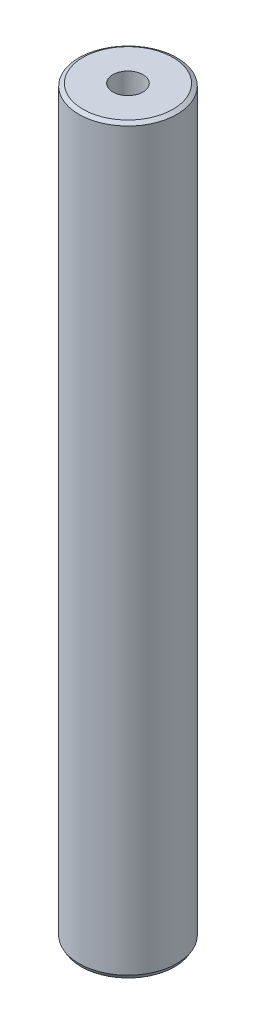
ISO-10303-21;
HEADER;
FILE_DESCRIPTION(('STEP AP214'),'2;1');
FILE_NAME('part.step','',(''),(''),'','','');
FILE_SCHEMA(('AUTOMOTIVE_DESIGN { 1 0 10303 214 1 1 1 1 }'));
ENDSEC;
DATA;
#1=APPLICATION_CONTEXT('core data for automotive mechanical design processes');
#2=APPLICATION_PROTOCOL_DEFINITION('international standard','automotive_design',2000,#1);
#3=PRODUCT_CONTEXT('',#1,'mechanical');
#4=PRODUCT('Part','Part','',(#3));
#5=PRODUCT_RELATED_PRODUCT_CATEGORY('part','',(#4));
#6=PRODUCT_DEFINITION_FORMATION('','',#4);
#7=PRODUCT_DEFINITION_CONTEXT('part definition',#1,'design');
#8=PRODUCT_DEFINITION('design','',#6,#7);
#9=PRODUCT_DEFINITION_SHAPE('','',#8);
#10=(LENGTH_UNIT() NAMED_UNIT(*) SI_UNIT(.MILLI.,.METRE.));
#11=(NAMED_UNIT(*) PLANE_ANGLE_UNIT() SI_UNIT($,.RADIAN.));
#12=(NAMED_UNIT(*) SI_UNIT($,.STERADIAN.) SOLID_ANGLE_UNIT());
#13=UNCERTAINTY_MEASURE_WITH_UNIT(LENGTH_MEASURE(1.E-05),#10,'distance_accuracy_value','');
#14=(GEOMETRIC_REPRESENTATION_CONTEXT(3) GLOBAL_UNCERTAINTY_ASSIGNED_CONTEXT((#13)) GLOBAL_UNIT_ASSIGNED_CONTEXT((#10,
#11,#12)) REPRESENTATION_CONTEXT('',''));
#15=CARTESIAN_POINT('',(0.,0.,0.));
#16=DIRECTION('',(0.,0.,1.));
#17=DIRECTION('',(1.,0.,0.));
#18=AXIS2_PLACEMENT_3D('',#15,#16,#17);
#19=CARTESIAN_POINT('',(0.,529.479482132108,0.));
#20=DIRECTION('',(0.,-1.,0.));
#21=DIRECTION('',(0.,0.,-1.));
#22=AXIS2_PLACEMENT_3D('',#19,#20,#21);
#23=CYLINDRICAL_SURFACE('',#22,35.);
#24=CARTESIAN_POINT('',(0.,527.811861999317,0.));
#25=DIRECTION('',(0.,1.,0.));
#26=DIRECTION('',(0.,0.,1.));
#27=AXIS2_PLACEMENT_3D('',#24,#25,#26);
#28=CIRCLE('',#27,35.);
#29=CARTESIAN_POINT('',(0.,527.811861999317,35.));
#30=VERTEX_POINT('',#29);
#31=EDGE_CURVE('E50',#30,#30,#28,.F.);
#32=ORIENTED_EDGE('',*,*,#31,.T.);
#33=EDGE_LOOP('',(#32));
#34=FACE_BOUND('',#33,.T.);
#35=CARTESIAN_POINT('',(0.,2.88840279771785,0.));
#36=DIRECTION('',(0.,1.,0.));
#37=DIRECTION('',(0.,0.,1.));
#38=AXIS2_PLACEMENT_3D('',#35,#36,#37);
#39=CIRCLE('',#38,35.);
#40=CARTESIAN_POINT('',(0.,2.88840279771785,35.));
#41=VERTEX_POINT('',#40);
#42=EDGE_CURVE('E51',#41,#41,#39,.T.);
#43=ORIENTED_EDGE('',*,*,#42,.T.);
#44=EDGE_LOOP('',(#43));
#45=FACE_BOUND('',#44,.T.);
#46=ADVANCED_FACE('F39',(#34,#45),#23,.T.);
#47=CARTESIAN_POINT('',(0.,529.479482132108,0.));
#48=DIRECTION('',(0.,1.,0.));
#49=DIRECTION('',(0.,0.,1.));
#50=AXIS2_PLACEMENT_3D('',#47,#48,#49);
#51=PLANE('',#50);
#52=CARTESIAN_POINT('',(0.,529.479482132108,0.));
#53=DIRECTION('',(0.,1.,0.));
#54=DIRECTION('',(0.,0.,1.));
#55=AXIS2_PLACEMENT_3D('',#52,#53,#54);
#56=CIRCLE('',#55,32.1115972022821);
#57=CARTESIAN_POINT('',(0.,529.479482132108,32.1115972022821));
#58=VERTEX_POINT('',#57);
#59=EDGE_CURVE('E54',#58,#58,#56,.T.);
#60=ORIENTED_EDGE('',*,*,#59,.T.);
#61=EDGE_LOOP('',(#60));
#62=FACE_BOUND('',#61,.T.);
#63=CARTESIAN_POINT('',(0.,529.479482132108,0.));
#64=DIRECTION('',(0.,1.,0.));
#65=DIRECTION('',(0.,0.,1.));
#66=AXIS2_PLACEMENT_3D('',#63,#64,#65);
#67=CIRCLE('',#66,10.7695642763049);
#68=CARTESIAN_POINT('',(0.,529.479482132108,10.7695642763049));
#69=VERTEX_POINT('',#68);
#70=EDGE_CURVE('E58',#69,#69,#67,.T.);
#71=ORIENTED_EDGE('',*,*,#70,.F.);
#72=EDGE_LOOP('',(#71));
#73=FACE_BOUND('',#72,.T.);
#74=ADVANCED_FACE('F69',(#62,#73),#51,.T.);
#75=CARTESIAN_POINT('',(0.,0.,0.));
#76=DIRECTION('',(0.,1.,0.));
#77=DIRECTION('',(0.,0.,1.));
#78=AXIS2_PLACEMENT_3D('',#75,#76,#77);
#79=PLANE('',#78);
#80=CARTESIAN_POINT('',(0.,0.,0.));
#81=DIRECTION('',(0.,1.,0.));
#82=DIRECTION('',(0.,0.,1.));
#83=AXIS2_PLACEMENT_3D('',#80,#81,#82);
#84=CIRCLE('',#83,33.3323798672095);
#85=CARTESIAN_POINT('',(0.,0.,33.3323798672095));
#86=VERTEX_POINT('',#85);
#87=EDGE_CURVE('E10',#86,#86,#84,.F.);
#88=ORIENTED_EDGE('',*,*,#87,.T.);
#89=EDGE_LOOP('',(#88));
#90=FACE_BOUND('',#89,.T.);
#91=CARTESIAN_POINT('',(0.,0.,0.));
#92=DIRECTION('',(0.,1.,0.));
#93=DIRECTION('',(0.,0.,1.));
#94=AXIS2_PLACEMENT_3D('',#91,#92,#93);
#95=CIRCLE('',#94,10.7695642763049);
#96=CARTESIAN_POINT('',(0.,0.,10.7695642763049));
#97=VERTEX_POINT('',#96);
#98=EDGE_CURVE('E63',#97,#97,#95,.T.);
#99=ORIENTED_EDGE('',*,*,#98,.T.);
#100=EDGE_LOOP('',(#99));
#101=FACE_BOUND('',#100,.T.);
#102=ADVANCED_FACE('F75',(#90,#101),#79,.F.);
#103=CARTESIAN_POINT('',(0.,529.479482132108,0.));
#104=DIRECTION('',(0.,-1.,0.));
#105=DIRECTION('',(0.,0.,-1.));
#106=AXIS2_PLACEMENT_3D('',#103,#104,#105);
#107=CYLINDRICAL_SURFACE('',#106,10.7695642763049);
#108=ORIENTED_EDGE('',*,*,#70,.T.);
#109=EDGE_LOOP('',(#108));
#110=FACE_BOUND('',#109,.T.);
#111=ORIENTED_EDGE('',*,*,#98,.F.);
#112=EDGE_LOOP('',(#111));
#113=FACE_BOUND('',#112,.T.);
#114=ADVANCED_FACE('F70',(#110,#113),#107,.F.);
#115=CARTESIAN_POINT('',(0.,529.479482132108,0.));
#116=DIRECTION('',(0.,-1.,0.));
#117=DIRECTION('',(0.,0.,-1.));
#118=AXIS2_PLACEMENT_3D('',#115,#116,#117);
#119=CONICAL_SURFACE('',#118,32.1115972022821,1.04719755119659);
#120=ORIENTED_EDGE('',*,*,#31,.F.);
#121=EDGE_LOOP('',(#120));
#122=FACE_BOUND('',#121,.T.);
#123=ORIENTED_EDGE('',*,*,#59,.F.);
#124=EDGE_LOOP('',(#123));
#125=FACE_BOUND('',#124,.T.);
#126=ADVANCED_FACE('F81',(#122,#125),#119,.T.);
#127=CARTESIAN_POINT('',(0.,2.88840279771785,0.));
#128=DIRECTION('',(0.,1.,0.));
#129=DIRECTION('',(0.,0.,1.));
#130=AXIS2_PLACEMENT_3D('',#127,#128,#129);
#131=CONICAL_SURFACE('',#130,35.,0.523598775598304);
#132=ORIENTED_EDGE('',*,*,#87,.F.);
#133=EDGE_LOOP('',(#132));
#134=FACE_BOUND('',#133,.T.);
#135=ORIENTED_EDGE('',*,*,#42,.F.);
#136=EDGE_LOOP('',(#135));
#137=FACE_BOUND('',#136,.T.);
#138=ADVANCED_FACE('F45',(#134,#137),#131,.T.);
#139=CLOSED_SHELL('',(#46,#74,#102,#114,#126,#138));
#140=MANIFOLD_SOLID_BREP('B2',#139);
#141=ADVANCED_BREP_SHAPE_REPRESENTATION('',(#18,#140),#14);
#142=SHAPE_DEFINITION_REPRESENTATION(#9,#141);
ENDSEC;
END-ISO-10303-21;
